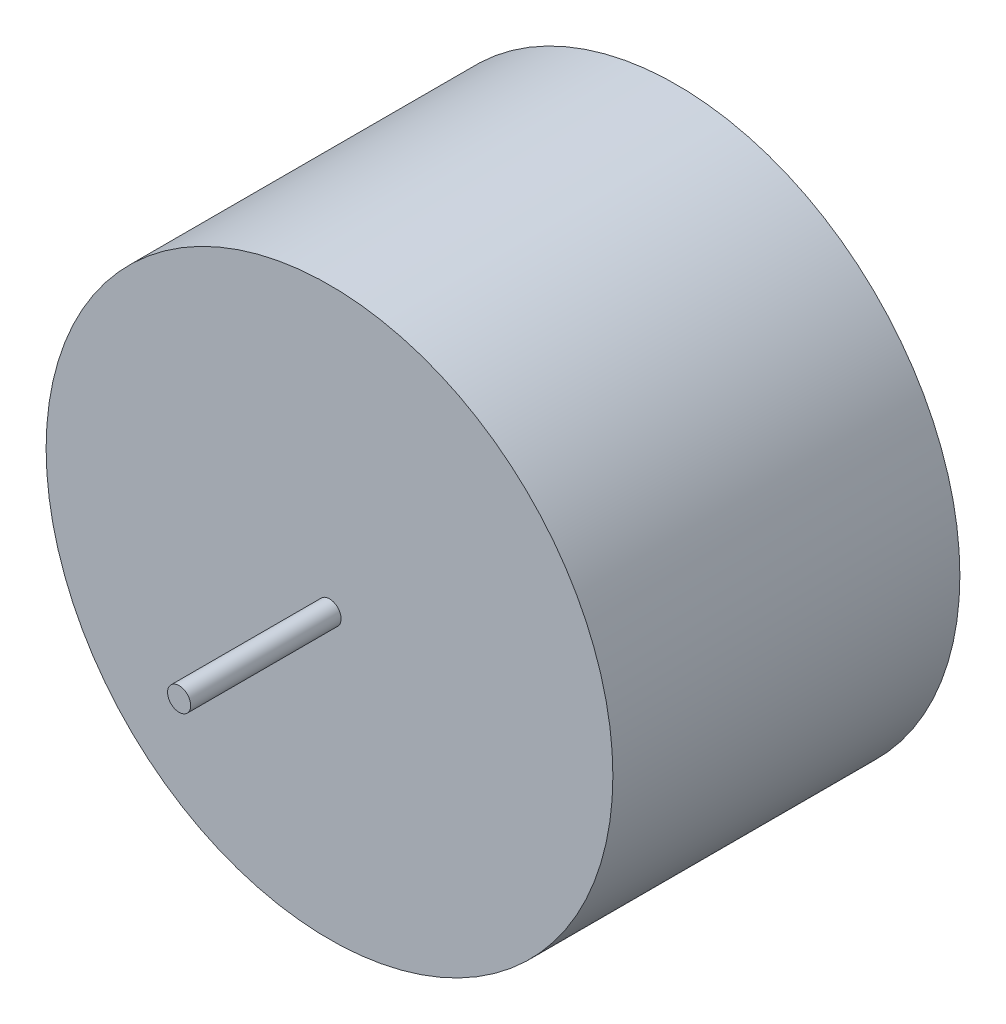
ISO-10303-21;
HEADER;
FILE_DESCRIPTION(('STEP AP214'),'2;1');
FILE_NAME('part.step','',(''),(''),'','','');
FILE_SCHEMA(('AUTOMOTIVE_DESIGN { 1 0 10303 214 1 1 1 1 }'));
ENDSEC;
DATA;
#1=APPLICATION_CONTEXT('core data for automotive mechanical design processes');
#2=APPLICATION_PROTOCOL_DEFINITION('international standard','automotive_design',2000,#1);
#3=PRODUCT_CONTEXT('',#1,'mechanical');
#4=PRODUCT('Part','Part','',(#3));
#5=PRODUCT_RELATED_PRODUCT_CATEGORY('part','',(#4));
#6=PRODUCT_DEFINITION_FORMATION('','',#4);
#7=PRODUCT_DEFINITION_CONTEXT('part definition',#1,'design');
#8=PRODUCT_DEFINITION('design','',#6,#7);
#9=PRODUCT_DEFINITION_SHAPE('','',#8);
#10=(LENGTH_UNIT() NAMED_UNIT(*) SI_UNIT(.MILLI.,.METRE.));
#11=(NAMED_UNIT(*) PLANE_ANGLE_UNIT() SI_UNIT($,.RADIAN.));
#12=(NAMED_UNIT(*) SI_UNIT($,.STERADIAN.) SOLID_ANGLE_UNIT());
#13=UNCERTAINTY_MEASURE_WITH_UNIT(LENGTH_MEASURE(1.E-05),#10,'distance_accuracy_value','');
#14=(GEOMETRIC_REPRESENTATION_CONTEXT(3) GLOBAL_UNCERTAINTY_ASSIGNED_CONTEXT((#13)) GLOBAL_UNIT_ASSIGNED_CONTEXT((#10,
#11,#12)) REPRESENTATION_CONTEXT('',''));
#15=CARTESIAN_POINT('',(0.,0.,0.));
#16=DIRECTION('',(0.,0.,1.));
#17=DIRECTION('',(1.,0.,0.));
#18=AXIS2_PLACEMENT_3D('',#15,#16,#17);
#19=CARTESIAN_POINT('',(0.,0.,105.));
#20=DIRECTION('',(0.,0.,-1.));
#21=DIRECTION('',(-1.,0.,0.));
#22=AXIS2_PLACEMENT_3D('',#19,#20,#21);
#23=CYLINDRICAL_SURFACE('',#22,85.75);
#24=CARTESIAN_POINT('',(0.,0.,105.));
#25=DIRECTION('',(0.,0.,1.));
#26=DIRECTION('',(1.,0.,0.));
#27=AXIS2_PLACEMENT_3D('',#24,#25,#26);
#28=CIRCLE('',#27,85.75);
#29=CARTESIAN_POINT('',(85.75,0.,105.));
#30=VERTEX_POINT('',#29);
#31=EDGE_CURVE('E44',#30,#30,#28,.T.);
#32=ORIENTED_EDGE('',*,*,#31,.F.);
#33=EDGE_LOOP('',(#32));
#34=FACE_BOUND('',#33,.T.);
#35=CARTESIAN_POINT('',(0.,0.,0.));
#36=DIRECTION('',(0.,0.,1.));
#37=DIRECTION('',(1.,0.,0.));
#38=AXIS2_PLACEMENT_3D('',#35,#36,#37);
#39=CIRCLE('',#38,85.75);
#40=CARTESIAN_POINT('',(85.75,0.,0.));
#41=VERTEX_POINT('',#40);
#42=EDGE_CURVE('E49',#41,#41,#39,.T.);
#43=ORIENTED_EDGE('',*,*,#42,.T.);
#44=EDGE_LOOP('',(#43));
#45=FACE_BOUND('',#44,.T.);
#46=ADVANCED_FACE('F37',(#34,#45),#23,.T.);
#47=CARTESIAN_POINT('',(0.,0.,105.));
#48=DIRECTION('',(0.,0.,1.));
#49=DIRECTION('',(1.,0.,0.));
#50=AXIS2_PLACEMENT_3D('',#47,#48,#49);
#51=PLANE('',#50);
#52=CARTESIAN_POINT('',(0.,0.,105.));
#53=DIRECTION('',(0.,0.,1.));
#54=DIRECTION('',(1.,0.,0.));
#55=AXIS2_PLACEMENT_3D('',#52,#53,#54);
#56=CIRCLE('',#55,3.5);
#57=CARTESIAN_POINT('',(3.5,0.,105.));
#58=VERTEX_POINT('',#57);
#59=EDGE_CURVE('E10',#58,#58,#56,.T.);
#60=ORIENTED_EDGE('',*,*,#59,.F.);
#61=EDGE_LOOP('',(#60));
#62=FACE_BOUND('',#61,.T.);
#63=ORIENTED_EDGE('',*,*,#31,.T.);
#64=EDGE_LOOP('',(#63));
#65=FACE_BOUND('',#64,.T.);
#66=ADVANCED_FACE('F80',(#62,#65),#51,.T.);
#67=CARTESIAN_POINT('',(0.,0.,0.));
#68=DIRECTION('',(0.,0.,1.));
#69=DIRECTION('',(1.,0.,0.));
#70=AXIS2_PLACEMENT_3D('',#67,#68,#69);
#71=PLANE('',#70);
#72=CARTESIAN_POINT('',(0.,0.,0.));
#73=DIRECTION('',(0.,0.,1.));
#74=DIRECTION('',(1.,0.,0.));
#75=AXIS2_PLACEMENT_3D('',#72,#73,#74);
#76=CIRCLE('',#75,21.);
#77=CARTESIAN_POINT('',(21.,0.,0.));
#78=VERTEX_POINT('',#77);
#79=EDGE_CURVE('E57',#78,#78,#76,.T.);
#80=ORIENTED_EDGE('',*,*,#79,.T.);
#81=EDGE_LOOP('',(#80));
#82=FACE_BOUND('',#81,.T.);
#83=ORIENTED_EDGE('',*,*,#42,.F.);
#84=EDGE_LOOP('',(#83));
#85=FACE_BOUND('',#84,.T.);
#86=ADVANCED_FACE('F85',(#82,#85),#71,.F.);
#87=CARTESIAN_POINT('',(0.,0.,-10.5));
#88=DIRECTION('',(0.,0.,1.));
#89=DIRECTION('',(1.,0.,0.));
#90=AXIS2_PLACEMENT_3D('',#87,#88,#89);
#91=CYLINDRICAL_SURFACE('',#90,21.);
#92=CARTESIAN_POINT('',(0.,0.,-10.5));
#93=DIRECTION('',(0.,0.,1.));
#94=DIRECTION('',(1.,0.,0.));
#95=AXIS2_PLACEMENT_3D('',#92,#93,#94);
#96=CIRCLE('',#95,21.);
#97=CARTESIAN_POINT('',(21.,0.,-10.5));
#98=VERTEX_POINT('',#97);
#99=EDGE_CURVE('E55',#98,#98,#96,.T.);
#100=ORIENTED_EDGE('',*,*,#99,.T.);
#101=EDGE_LOOP('',(#100));
#102=FACE_BOUND('',#101,.T.);
#103=ORIENTED_EDGE('',*,*,#79,.F.);
#104=EDGE_LOOP('',(#103));
#105=FACE_BOUND('',#104,.T.);
#106=ADVANCED_FACE('F92',(#102,#105),#91,.T.);
#107=CARTESIAN_POINT('',(0.,0.,-10.5));
#108=DIRECTION('',(0.,0.,1.));
#109=DIRECTION('',(1.,0.,0.));
#110=AXIS2_PLACEMENT_3D('',#107,#108,#109);
#111=PLANE('',#110);
#112=ORIENTED_EDGE('',*,*,#99,.F.);
#113=EDGE_LOOP('',(#112));
#114=FACE_BOUND('',#113,.T.);
#115=ADVANCED_FACE('F77',(#114),#111,.F.);
#116=CARTESIAN_POINT('',(0.,0.,150.5));
#117=DIRECTION('',(0.,0.,-1.));
#118=DIRECTION('',(-1.,0.,0.));
#119=AXIS2_PLACEMENT_3D('',#116,#117,#118);
#120=CYLINDRICAL_SURFACE('',#119,3.5);
#121=ORIENTED_EDGE('',*,*,#59,.T.);
#122=EDGE_LOOP('',(#121));
#123=FACE_BOUND('',#122,.T.);
#124=CARTESIAN_POINT('',(0.,0.,150.5));
#125=DIRECTION('',(0.,0.,-1.));
#126=DIRECTION('',(-1.,0.,0.));
#127=AXIS2_PLACEMENT_3D('',#124,#125,#126);
#128=CIRCLE('',#127,3.5);
#129=CARTESIAN_POINT('',(-3.5,0.,150.5));
#130=VERTEX_POINT('',#129);
#131=EDGE_CURVE('E61',#130,#130,#128,.T.);
#132=ORIENTED_EDGE('',*,*,#131,.T.);
#133=EDGE_LOOP('',(#132));
#134=FACE_BOUND('',#133,.T.);
#135=ADVANCED_FACE('F69',(#123,#134),#120,.T.);
#136=CARTESIAN_POINT('',(0.,0.,150.5));
#137=DIRECTION('',(0.,0.,-1.));
#138=DIRECTION('',(-1.,0.,0.));
#139=AXIS2_PLACEMENT_3D('',#136,#137,#138);
#140=PLANE('',#139);
#141=ORIENTED_EDGE('',*,*,#131,.F.);
#142=EDGE_LOOP('',(#141));
#143=FACE_BOUND('',#142,.T.);
#144=ADVANCED_FACE('F71',(#143),#140,.F.);
#145=CLOSED_SHELL('',(#46,#66,#86,#106,#115,#135,#144));
#146=MANIFOLD_SOLID_BREP('B2',#145);
#147=ADVANCED_BREP_SHAPE_REPRESENTATION('',(#18,#146),#14);
#148=SHAPE_DEFINITION_REPRESENTATION(#9,#147);
ENDSEC;
END-ISO-10303-21;
